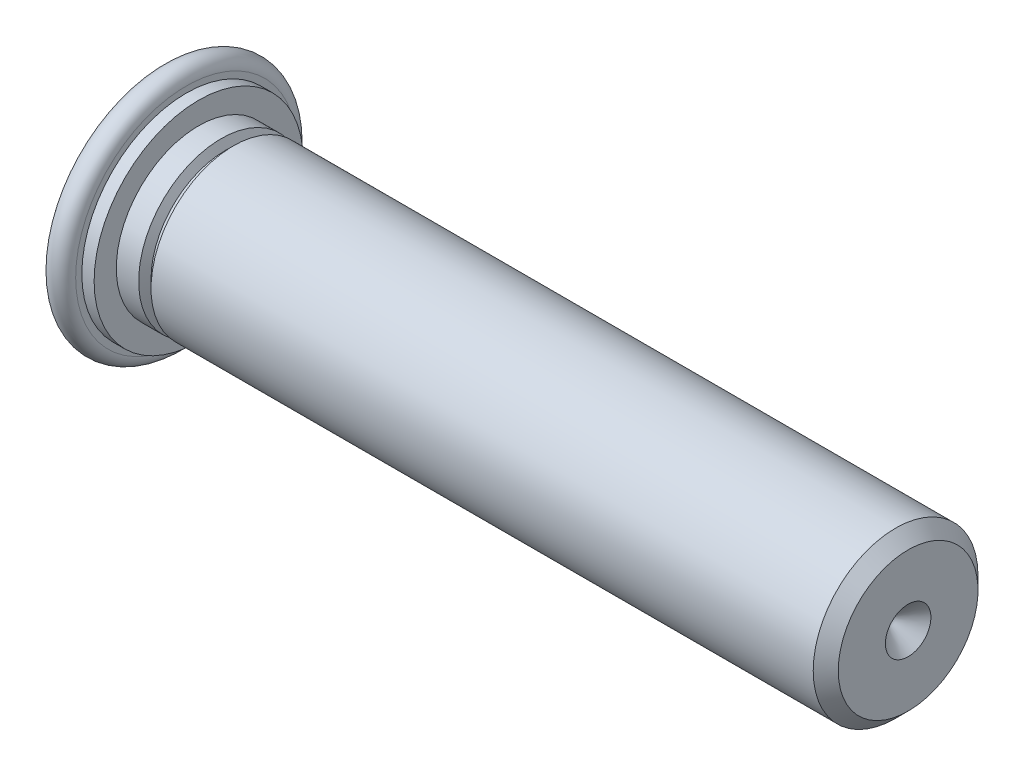
ISO-10303-21;
HEADER;
FILE_DESCRIPTION(('STEP AP214'),'2;1');
FILE_NAME('part.step','',(''),(''),'','','');
FILE_SCHEMA(('AUTOMOTIVE_DESIGN { 1 0 10303 214 1 1 1 1 }'));
ENDSEC;
DATA;
#1=APPLICATION_CONTEXT('core data for automotive mechanical design processes');
#2=APPLICATION_PROTOCOL_DEFINITION('international standard','automotive_design',2000,#1);
#3=PRODUCT_CONTEXT('',#1,'mechanical');
#4=PRODUCT('Part','Part','',(#3));
#5=PRODUCT_RELATED_PRODUCT_CATEGORY('part','',(#4));
#6=PRODUCT_DEFINITION_FORMATION('','',#4);
#7=PRODUCT_DEFINITION_CONTEXT('part definition',#1,'design');
#8=PRODUCT_DEFINITION('design','',#6,#7);
#9=PRODUCT_DEFINITION_SHAPE('','',#8);
#10=(LENGTH_UNIT() NAMED_UNIT(*) SI_UNIT(.MILLI.,.METRE.));
#11=(NAMED_UNIT(*) PLANE_ANGLE_UNIT() SI_UNIT($,.RADIAN.));
#12=(NAMED_UNIT(*) SI_UNIT($,.STERADIAN.) SOLID_ANGLE_UNIT());
#13=UNCERTAINTY_MEASURE_WITH_UNIT(LENGTH_MEASURE(1.E-05),#10,'distance_accuracy_value','');
#14=(GEOMETRIC_REPRESENTATION_CONTEXT(3) GLOBAL_UNCERTAINTY_ASSIGNED_CONTEXT((#13)) GLOBAL_UNIT_ASSIGNED_CONTEXT((#10,
#11,#12)) REPRESENTATION_CONTEXT('',''));
#15=CARTESIAN_POINT('',(0.,0.,0.));
#16=DIRECTION('',(0.,0.,1.));
#17=DIRECTION('',(1.,0.,0.));
#18=AXIS2_PLACEMENT_3D('',#15,#16,#17);
#19=CARTESIAN_POINT('',(15.875,0.,0.));
#20=DIRECTION('',(1.,0.,0.));
#21=DIRECTION('',(0.,0.,-1.));
#22=AXIS2_PLACEMENT_3D('',#19,#20,#21);
#23=CONICAL_SURFACE('',#22,0.483997,0.785398163397445);
#24=CARTESIAN_POINT('',(15.391003,0.,0.));
#25=VERTEX_POINT('',#24);
#26=VERTEX_LOOP('',#25);
#27=FACE_BOUND('',#26,.T.);
#28=CARTESIAN_POINT('',(15.875,0.,0.));
#29=DIRECTION('',(1.,0.,0.));
#30=DIRECTION('',(0.,0.,-1.));
#31=AXIS2_PLACEMENT_3D('',#28,#29,#30);
#32=CIRCLE('',#31,0.483997);
#33=CARTESIAN_POINT('',(15.875,0.,-0.483997));
#34=VERTEX_POINT('',#33);
#35=EDGE_CURVE('E21',#34,#34,#32,.F.);
#36=ORIENTED_EDGE('',*,*,#35,.F.);
#37=EDGE_LOOP('',(#36));
#38=FACE_BOUND('',#37,.T.);
#39=ADVANCED_FACE('F17',(#27,#38),#23,.F.);
#40=CARTESIAN_POINT('',(15.875,-1.4859,1.4859));
#41=DIRECTION('',(1.,0.,0.));
#42=DIRECTION('',(0.,0.,-1.));
#43=AXIS2_PLACEMENT_3D('',#40,#41,#42);
#44=PLANE('',#43);
#45=ORIENTED_EDGE('',*,*,#35,.T.);
#46=EDGE_LOOP('',(#45));
#47=FACE_BOUND('',#46,.T.);
#48=CARTESIAN_POINT('',(15.875,0.,0.));
#49=DIRECTION('',(-1.,0.,0.));
#50=DIRECTION('',(0.,0.,1.));
#51=AXIS2_PLACEMENT_3D('',#48,#49,#50);
#52=CIRCLE('',#51,1.4859);
#53=CARTESIAN_POINT('',(15.875,0.,1.4859));
#54=VERTEX_POINT('',#53);
#55=EDGE_CURVE('E36',#54,#54,#52,.T.);
#56=ORIENTED_EDGE('',*,*,#55,.F.);
#57=EDGE_LOOP('',(#56));
#58=FACE_BOUND('',#57,.T.);
#59=ADVANCED_FACE('F31',(#47,#58),#44,.T.);
#60=CARTESIAN_POINT('',(15.6083,0.,0.));
#61=DIRECTION('',(-1.,0.,0.));
#62=DIRECTION('',(0.,0.,1.));
#63=AXIS2_PLACEMENT_3D('',#60,#61,#62);
#64=CONICAL_SURFACE('',#63,1.7526,0.785398163397439);
#65=ORIENTED_EDGE('',*,*,#55,.T.);
#66=EDGE_LOOP('',(#65));
#67=FACE_BOUND('',#66,.T.);
#68=CARTESIAN_POINT('',(15.6083,0.,0.));
#69=DIRECTION('',(1.,0.,0.));
#70=DIRECTION('',(0.,0.,-1.));
#71=AXIS2_PLACEMENT_3D('',#68,#69,#70);
#72=CIRCLE('',#71,1.7526);
#73=CARTESIAN_POINT('',(15.6083,0.,-1.7526));
#74=VERTEX_POINT('',#73);
#75=EDGE_CURVE('E38',#74,#74,#72,.F.);
#76=ORIENTED_EDGE('',*,*,#75,.F.);
#77=EDGE_LOOP('',(#76));
#78=FACE_BOUND('',#77,.T.);
#79=ADVANCED_FACE('F139',(#67,#78),#64,.T.);
#80=CARTESIAN_POINT('',(1.524,0.,0.));
#81=DIRECTION('',(1.,0.,0.));
#82=DIRECTION('',(0.,0.,-1.));
#83=AXIS2_PLACEMENT_3D('',#80,#81,#82);
#84=CYLINDRICAL_SURFACE('',#83,1.7526);
#85=ORIENTED_EDGE('',*,*,#75,.T.);
#86=EDGE_LOOP('',(#85));
#87=FACE_BOUND('',#86,.T.);
#88=CARTESIAN_POINT('',(1.524,0.,0.));
#89=DIRECTION('',(1.,0.,0.));
#90=DIRECTION('',(0.,0.,-1.));
#91=AXIS2_PLACEMENT_3D('',#88,#89,#90);
#92=CIRCLE('',#91,1.7526);
#93=CARTESIAN_POINT('',(1.524,0.,-1.7526));
#94=VERTEX_POINT('',#93);
#95=EDGE_CURVE('E42',#94,#94,#92,.F.);
#96=ORIENTED_EDGE('',*,*,#95,.F.);
#97=EDGE_LOOP('',(#96));
#98=FACE_BOUND('',#97,.T.);
#99=ADVANCED_FACE('F131',(#87,#98),#84,.T.);
#100=CARTESIAN_POINT('',(1.43637,0.,0.));
#101=DIRECTION('',(1.,0.,0.));
#102=DIRECTION('',(0.,0.,-1.));
#103=AXIS2_PLACEMENT_3D('',#100,#101,#102);
#104=CONICAL_SURFACE('',#103,1.57734,1.10714871779409);
#105=CARTESIAN_POINT('',(1.43637,0.,0.));
#106=DIRECTION('',(1.,0.,0.));
#107=DIRECTION('',(0.,0.,-1.));
#108=AXIS2_PLACEMENT_3D('',#105,#106,#107);
#109=CIRCLE('',#108,1.57733999999997);
#110=CARTESIAN_POINT('',(1.43637,0.,-1.57733999999997));
#111=VERTEX_POINT('',#110);
#112=EDGE_CURVE('E47',#111,#111,#109,.F.);
#113=ORIENTED_EDGE('',*,*,#112,.F.);
#114=EDGE_LOOP('',(#113));
#115=FACE_BOUND('',#114,.T.);
#116=ORIENTED_EDGE('',*,*,#95,.T.);
#117=EDGE_LOOP('',(#116));
#118=FACE_BOUND('',#117,.T.);
#119=ADVANCED_FACE('F123',(#115,#118),#104,.T.);
#120=CARTESIAN_POINT('',(1.392555,0.,0.));
#121=DIRECTION('',(1.,0.,0.));
#122=DIRECTION('',(0.,0.,-1.));
#123=AXIS2_PLACEMENT_3D('',#120,#121,#122);
#124=TOROIDAL_SURFACE('',#123,1.6532298061336,0.08763);
#125=ORIENTED_EDGE('',*,*,#112,.T.);
#126=EDGE_LOOP('',(#125));
#127=FACE_BOUND('',#126,.T.);
#128=CARTESIAN_POINT('',(1.34874000000001,0.,0.));
#129=DIRECTION('',(-1.,0.,0.));
#130=DIRECTION('',(0.,0.,1.));
#131=AXIS2_PLACEMENT_3D('',#128,#129,#130);
#132=CIRCLE('',#131,1.57733999999999);
#133=CARTESIAN_POINT('',(1.34874000000001,0.,1.57733999999999));
#134=VERTEX_POINT('',#133);
#135=EDGE_CURVE('E50',#134,#134,#132,.T.);
#136=ORIENTED_EDGE('',*,*,#135,.F.);
#137=EDGE_LOOP('',(#136));
#138=FACE_BOUND('',#137,.T.);
#139=ADVANCED_FACE('F115',(#127,#138),#124,.F.);
#140=CARTESIAN_POINT('',(1.26111,0.,0.));
#141=DIRECTION('',(-1.,0.,0.));
#142=DIRECTION('',(0.,0.,1.));
#143=AXIS2_PLACEMENT_3D('',#140,#141,#142);
#144=CONICAL_SURFACE('',#143,1.7526,1.10714871779409);
#145=CARTESIAN_POINT('',(1.26111,0.,0.));
#146=DIRECTION('',(1.,0.,0.));
#147=DIRECTION('',(0.,0.,-1.));
#148=AXIS2_PLACEMENT_3D('',#145,#146,#147);
#149=CIRCLE('',#148,1.7526);
#150=CARTESIAN_POINT('',(1.26111,0.,-1.7526));
#151=VERTEX_POINT('',#150);
#152=EDGE_CURVE('E53',#151,#151,#149,.F.);
#153=ORIENTED_EDGE('',*,*,#152,.F.);
#154=EDGE_LOOP('',(#153));
#155=FACE_BOUND('',#154,.T.);
#156=ORIENTED_EDGE('',*,*,#135,.T.);
#157=EDGE_LOOP('',(#156));
#158=FACE_BOUND('',#157,.T.);
#159=ADVANCED_FACE('F91',(#155,#158),#144,.T.);
#160=CARTESIAN_POINT('',(0.78486,0.,0.));
#161=DIRECTION('',(1.,0.,0.));
#162=DIRECTION('',(0.,0.,-1.));
#163=AXIS2_PLACEMENT_3D('',#160,#161,#162);
#164=CYLINDRICAL_SURFACE('',#163,1.7526);
#165=ORIENTED_EDGE('',*,*,#152,.T.);
#166=EDGE_LOOP('',(#165));
#167=FACE_BOUND('',#166,.T.);
#168=CARTESIAN_POINT('',(0.78486,0.,0.));
#169=DIRECTION('',(1.,0.,0.));
#170=DIRECTION('',(0.,0.,-1.));
#171=AXIS2_PLACEMENT_3D('',#168,#169,#170);
#172=CIRCLE('',#171,1.7526);
#173=CARTESIAN_POINT('',(0.78486,0.,-1.7526));
#174=VERTEX_POINT('',#173);
#175=EDGE_CURVE('E56',#174,#174,#172,.F.);
#176=ORIENTED_EDGE('',*,*,#175,.F.);
#177=EDGE_LOOP('',(#176));
#178=FACE_BOUND('',#177,.T.);
#179=ADVANCED_FACE('F80',(#167,#178),#164,.T.);
#180=CARTESIAN_POINT('',(0.78486,2.22377,-2.22377));
#181=DIRECTION('',(1.,0.,0.));
#182=DIRECTION('',(0.,0.,1.));
#183=AXIS2_PLACEMENT_3D('',#180,#181,#182);
#184=PLANE('',#183);
#185=ORIENTED_EDGE('',*,*,#175,.T.);
#186=EDGE_LOOP('',(#185));
#187=FACE_BOUND('',#186,.T.);
#188=CARTESIAN_POINT('',(0.78486,0.,0.));
#189=DIRECTION('',(-1.,0.,0.));
#190=DIRECTION('',(0.,0.,1.));
#191=AXIS2_PLACEMENT_3D('',#188,#189,#190);
#192=CIRCLE('',#191,2.22377);
#193=CARTESIAN_POINT('',(0.78486,0.,2.22377));
#194=VERTEX_POINT('',#193);
#195=EDGE_CURVE('E59',#194,#194,#192,.T.);
#196=ORIENTED_EDGE('',*,*,#195,.F.);
#197=EDGE_LOOP('',(#196));
#198=FACE_BOUND('',#197,.T.);
#199=ADVANCED_FACE('F78',(#187,#198),#184,.T.);
#200=CARTESIAN_POINT('',(0.,-2.35458,-2.35458));
#201=DIRECTION('',(-1.,0.,0.));
#202=DIRECTION('',(0.,0.,1.));
#203=AXIS2_PLACEMENT_3D('',#200,#201,#202);
#204=PLANE('',#203);
#205=CARTESIAN_POINT('',(0.,0.,0.));
#206=DIRECTION('',(1.,0.,0.));
#207=DIRECTION('',(0.,0.,-1.));
#208=AXIS2_PLACEMENT_3D('',#205,#206,#207);
#209=CIRCLE('',#208,2.35458);
#210=CARTESIAN_POINT('',(0.,0.,-2.35458));
#211=VERTEX_POINT('',#210);
#212=EDGE_CURVE('E62',#211,#211,#209,.T.);
#213=ORIENTED_EDGE('',*,*,#212,.F.);
#214=EDGE_LOOP('',(#213));
#215=FACE_BOUND('',#214,.T.);
#216=ADVANCED_FACE('F74',(#215),#204,.T.);
#217=CARTESIAN_POINT('',(0.78486,0.,0.));
#218=DIRECTION('',(-1.,0.,0.));
#219=DIRECTION('',(0.,0.,1.));
#220=AXIS2_PLACEMENT_3D('',#217,#218,#219);
#221=CYLINDRICAL_SURFACE('',#220,2.22377);
#222=CARTESIAN_POINT('',(0.52324,0.,0.));
#223=DIRECTION('',(-1.,0.,0.));
#224=DIRECTION('',(0.,0.,1.));
#225=AXIS2_PLACEMENT_3D('',#222,#223,#224);
#226=CIRCLE('',#225,2.22377);
#227=CARTESIAN_POINT('',(0.52324,0.,2.22377));
#228=VERTEX_POINT('',#227);
#229=EDGE_CURVE('E25',#228,#228,#226,.T.);
#230=ORIENTED_EDGE('',*,*,#229,.F.);
#231=EDGE_LOOP('',(#230));
#232=FACE_BOUND('',#231,.T.);
#233=ORIENTED_EDGE('',*,*,#195,.T.);
#234=EDGE_LOOP('',(#233));
#235=FACE_BOUND('',#234,.T.);
#236=ADVANCED_FACE('F71',(#232,#235),#221,.T.);
#237=CARTESIAN_POINT('',(0.52324,-2.35458,2.35458));
#238=DIRECTION('',(1.,0.,0.));
#239=DIRECTION('',(0.,0.,-1.));
#240=AXIS2_PLACEMENT_3D('',#237,#238,#239);
#241=PLANE('',#240);
#242=ORIENTED_EDGE('',*,*,#229,.T.);
#243=EDGE_LOOP('',(#242));
#244=FACE_BOUND('',#243,.T.);
#245=CARTESIAN_POINT('',(0.52324,0.,0.));
#246=DIRECTION('',(1.,0.,0.));
#247=DIRECTION('',(0.,0.,-1.));
#248=AXIS2_PLACEMENT_3D('',#245,#246,#247);
#249=CIRCLE('',#248,2.35458);
#250=CARTESIAN_POINT('',(0.52324,0.,-2.35458));
#251=VERTEX_POINT('',#250);
#252=EDGE_CURVE('E11',#251,#251,#249,.F.);
#253=ORIENTED_EDGE('',*,*,#252,.F.);
#254=EDGE_LOOP('',(#253));
#255=FACE_BOUND('',#254,.T.);
#256=ADVANCED_FACE('F68',(#244,#255),#241,.T.);
#257=CARTESIAN_POINT('',(0.26162,0.,0.));
#258=DIRECTION('',(1.,0.,0.));
#259=DIRECTION('',(0.,0.,-1.));
#260=AXIS2_PLACEMENT_3D('',#257,#258,#259);
#261=TOROIDAL_SURFACE('',#260,2.35458,0.26162);
#262=ORIENTED_EDGE('',*,*,#212,.T.);
#263=EDGE_LOOP('',(#262));
#264=FACE_BOUND('',#263,.T.);
#265=ORIENTED_EDGE('',*,*,#252,.T.);
#266=EDGE_LOOP('',(#265));
#267=FACE_BOUND('',#266,.T.);
#268=ADVANCED_FACE('F19',(#264,#267),#261,.T.);
#269=CLOSED_SHELL('',(#39,#59,#79,#99,#119,#139,#159,#179,#199,#216,#236,#256,#268));
#270=MANIFOLD_SOLID_BREP('B1',#269);
#271=ADVANCED_BREP_SHAPE_REPRESENTATION('',(#18,#270),#14);
#272=SHAPE_DEFINITION_REPRESENTATION(#9,#271);
ENDSEC;
END-ISO-10303-21;
